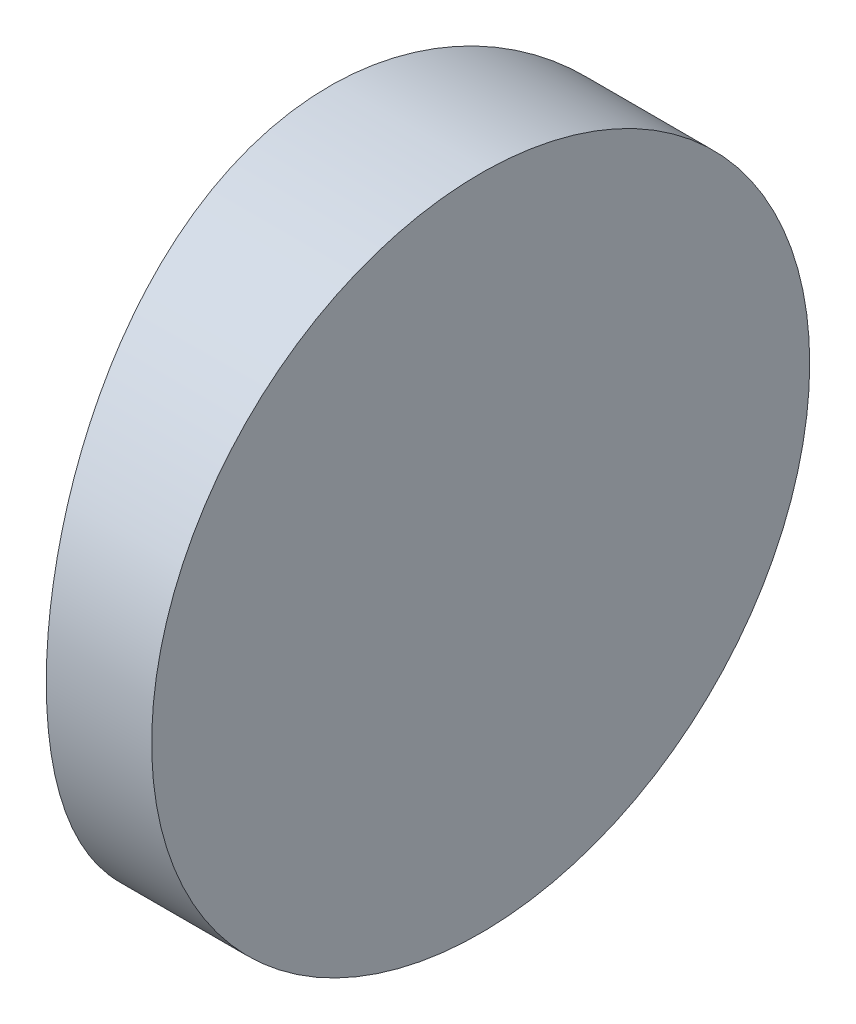
ISO-10303-21;
HEADER;
FILE_DESCRIPTION(('STEP AP214'),'2;1');
FILE_NAME('part.step','',(''),(''),'','','');
FILE_SCHEMA(('AUTOMOTIVE_DESIGN { 1 0 10303 214 1 1 1 1 }'));
ENDSEC;
DATA;
#1=APPLICATION_CONTEXT('core data for automotive mechanical design processes');
#2=APPLICATION_PROTOCOL_DEFINITION('international standard','automotive_design',2000,#1);
#3=PRODUCT_CONTEXT('',#1,'mechanical');
#4=PRODUCT('Part','Part','',(#3));
#5=PRODUCT_RELATED_PRODUCT_CATEGORY('part','',(#4));
#6=PRODUCT_DEFINITION_FORMATION('','',#4);
#7=PRODUCT_DEFINITION_CONTEXT('part definition',#1,'design');
#8=PRODUCT_DEFINITION('design','',#6,#7);
#9=PRODUCT_DEFINITION_SHAPE('','',#8);
#10=(LENGTH_UNIT() NAMED_UNIT(*) SI_UNIT(.MILLI.,.METRE.));
#11=(NAMED_UNIT(*) PLANE_ANGLE_UNIT() SI_UNIT($,.RADIAN.));
#12=(NAMED_UNIT(*) SI_UNIT($,.STERADIAN.) SOLID_ANGLE_UNIT());
#13=UNCERTAINTY_MEASURE_WITH_UNIT(LENGTH_MEASURE(1.E-05),#10,'distance_accuracy_value','');
#14=(GEOMETRIC_REPRESENTATION_CONTEXT(3) GLOBAL_UNCERTAINTY_ASSIGNED_CONTEXT((#13)) GLOBAL_UNIT_ASSIGNED_CONTEXT((#10,
#11,#12)) REPRESENTATION_CONTEXT('',''));
#15=CARTESIAN_POINT('',(0.,0.,0.));
#16=DIRECTION('',(0.,0.,1.));
#17=DIRECTION('',(1.,0.,0.));
#18=AXIS2_PLACEMENT_3D('',#15,#16,#17);
#19=CARTESIAN_POINT('',(4.35520433485127,12.5,0.));
#20=DIRECTION('',(0.,-1.,0.));
#21=DIRECTION('',(0.,0.,-1.));
#22=AXIS2_PLACEMENT_3D('',#19,#20,#21);
#23=CYLINDRICAL_SURFACE('',#22,22.93);
#24=CARTESIAN_POINT('',(-18.5747956651487,0.,0.));
#25=CARTESIAN_POINT('',(-18.5747975075132,-2.88206497799268E-06,-0.172116240904446));
#26=CARTESIAN_POINT('',(-18.5728542269794,0.0071125454654135,-0.3441960300636));
#27=CARTESIAN_POINT('',(-18.5651386677144,0.0355070712004434,-0.687149683150332));
#28=CARTESIAN_POINT('',(-18.5593656169787,0.056789025094106,-0.858023296917187));
#29=CARTESIAN_POINT('',(-18.5441420510763,0.113355737975695,-1.19737687240445));
#30=CARTESIAN_POINT('',(-18.534689178403,0.148649474009383,-1.36585522771707));
#31=CARTESIAN_POINT('',(-18.5123625379675,0.232952076452736,-1.69917642373395));
#32=CARTESIAN_POINT('',(-18.4994874887868,0.281966080720866,-1.86401787752476));
#33=CARTESIAN_POINT('',(-18.4706928395424,0.39320363664323,-2.18856018243164));
#34=CARTESIAN_POINT('',(-18.4547791016128,0.455401778940593,-2.34827025084624));
#35=CARTESIAN_POINT('',(-18.4203190141343,0.592575304890273,-2.6618366498111));
#36=CARTESIAN_POINT('',(-18.4017716782061,0.667555478003608,-2.81569075958679));
#37=CARTESIAN_POINT('',(-18.342916169584,0.91079141695951,-3.26677908619516));
#38=CARTESIAN_POINT('',(-18.2993608546125,1.09746693404617,-3.55390004287187));
#39=CARTESIAN_POINT('',(-18.2071322412475,1.51928384342409,-4.09929797343014));
#40=CARTESIAN_POINT('',(-18.1583685133213,1.75538752958156,-4.35681537706257));
#41=CARTESIAN_POINT('',(-18.0859761202817,2.13903824187728,-4.71093577418671));
#42=CARTESIAN_POINT('',(-18.0619544685581,2.27194003774992,-4.82368359085263));
#43=CARTESIAN_POINT('',(-18.014819735919,2.54677427434222,-5.03774887152665));
#44=CARTESIAN_POINT('',(-17.991706319745,2.68870333117802,-5.13907057959527));
#45=CARTESIAN_POINT('',(-17.9466134252116,2.98345979122966,-5.33139525573794));
#46=CARTESIAN_POINT('',(-17.9246636229312,3.13644244248912,-5.42216708887961));
#47=CARTESIAN_POINT('',(-17.8830414346436,3.449772827062,-5.59042344054706));
#48=CARTESIAN_POINT('',(-17.863368182456,3.6101177265413,-5.66791301813434));
#49=CARTESIAN_POINT('',(-17.8269078841955,3.93698361727225,-5.80896787054114));
#50=CARTESIAN_POINT('',(-17.8101184323237,4.10349931815857,-5.87254476421679));
#51=CARTESIAN_POINT('',(-17.7799362605068,4.44157285413049,-5.98530267421701));
#52=CARTESIAN_POINT('',(-17.7665426874325,4.6131294107181,-6.03448730671553));
#53=CARTESIAN_POINT('',(-17.7392472048781,5.02560846695819,-6.13381944691714));
#54=CARTESIAN_POINT('',(-17.7270605671705,5.26827811700073,-6.17732696870115));
#55=CARTESIAN_POINT('',(-17.7107294861358,5.75732358696326,-6.23541445556271));
#56=CARTESIAN_POINT('',(-17.7065846522162,6.00369922629656,-6.24999582559206));
#57=CARTESIAN_POINT('',(-17.7065795212784,6.42198282749614,-6.25000291483648));
#58=CARTESIAN_POINT('',(-17.7085968428445,6.59392915261917,-6.24289839954038));
#59=CARTESIAN_POINT('',(-17.7165993367766,6.93661216181474,-6.21454855376605));
#60=CARTESIAN_POINT('',(-17.7225853133849,7.10734859361473,-6.19330035708734));
#61=CARTESIAN_POINT('',(-17.7383494895108,7.44642456850869,-6.13682599336154));
#62=CARTESIAN_POINT('',(-17.748130173868,7.61476246596536,-6.10159066695166));
#63=CARTESIAN_POINT('',(-17.7711896834984,7.94779946494616,-6.01743216599849));
#64=CARTESIAN_POINT('',(-17.7844698259991,8.1124971709145,-5.96850383685538));
#65=CARTESIAN_POINT('',(-17.8141033205124,8.43673358687494,-5.85747309663171));
#66=CARTESIAN_POINT('',(-17.8304503488175,8.5962821345124,-5.79539776042242));
#67=CARTESIAN_POINT('',(-17.8657603204923,8.90953859283563,-5.65849934377744));
#68=CARTESIAN_POINT('',(-17.8847242451198,9.06324428492062,-5.58367147904053));
#69=CARTESIAN_POINT('',(-17.9447339176028,9.51392627901896,-5.34092843621856));
#70=CARTESIAN_POINT('',(-17.9889318450907,9.80082279936279,-5.15463146388042));
#71=CARTESIAN_POINT('',(-18.0820197481522,10.3464432933681,-4.73320884681729));
#72=CARTESIAN_POINT('',(-18.1309957797875,10.6043435616937,-4.49703552378388));
#73=CARTESIAN_POINT('',(-18.203250367609,10.9590248641308,-4.11315819535979));
#74=CARTESIAN_POINT('',(-18.2271495309637,11.0719564333349,-3.98016208423864));
#75=CARTESIAN_POINT('',(-18.2739042211193,11.2863768092485,-3.7051008070317));
#76=CARTESIAN_POINT('',(-18.2967601361445,11.3878698935641,-3.56303906252281));
#77=CARTESIAN_POINT('',(-18.3411965075896,11.5803983279381,-3.26816656150908));
#78=CARTESIAN_POINT('',(-18.3627473649779,11.6712177037604,-3.11521043114733));
#79=CARTESIAN_POINT('',(-18.4035092006859,11.8395715926047,-2.80192731255713));
#80=CARTESIAN_POINT('',(-18.4227210687718,11.9171111619415,-2.64160315934168));
#81=CARTESIAN_POINT('',(-18.4582498044354,12.0582663315697,-2.3147777190174));
#82=CARTESIAN_POINT('',(-18.474569031369,12.1218932895413,-2.14828160130228));
#83=CARTESIAN_POINT('',(-18.5038567179117,12.2347500199831,-1.81025467189861));
#84=CARTESIAN_POINT('',(-18.5168260081135,12.2839833616469,-1.63872511998229));
#85=CARTESIAN_POINT('',(-18.5432520539355,12.3835193705341,-1.22596271185158));
#86=CARTESIAN_POINT('',(-18.555026722623,12.4271401985556,-0.98297626549877));
#87=CARTESIAN_POINT('',(-18.5707970441783,12.4853778364874,-0.493301496475726));
#88=CARTESIAN_POINT('',(-18.5747930253535,12.4999958704906,-0.246613330483184));
#89=CARTESIAN_POINT('',(-18.5747975075132,12.500002882065,0.172116240904446));
#90=CARTESIAN_POINT('',(-18.5728542269794,12.4928874545346,0.3441960300636));
#91=CARTESIAN_POINT('',(-18.5651386677144,12.4644929287996,0.687149683150331));
#92=CARTESIAN_POINT('',(-18.5593656169787,12.4432109749059,0.858023296917186));
#93=CARTESIAN_POINT('',(-18.5441420510763,12.3866442620243,1.19737687240444));
#94=CARTESIAN_POINT('',(-18.534689178403,12.3513505259906,1.36585522771707));
#95=CARTESIAN_POINT('',(-18.5123625379675,12.2670479235473,1.69917642373395));
#96=CARTESIAN_POINT('',(-18.4994874887868,12.2180339192791,1.86401787752476));
#97=CARTESIAN_POINT('',(-18.4706928395424,12.1067963633568,2.18856018243164));
#98=CARTESIAN_POINT('',(-18.4547791016128,12.0445982210594,2.34827025084624));
#99=CARTESIAN_POINT('',(-18.4203190141343,11.9074246951097,2.6618366498111));
#100=CARTESIAN_POINT('',(-18.4017716782061,11.8324445219964,2.81569075958679));
#101=CARTESIAN_POINT('',(-18.342916169584,11.5892085830405,3.26677908619516));
#102=CARTESIAN_POINT('',(-18.2993608546125,11.4025330659538,3.55390004287187));
#103=CARTESIAN_POINT('',(-18.2071322412475,10.9807161565759,4.09929797343014));
#104=CARTESIAN_POINT('',(-18.1583685133213,10.7446124704184,4.35681537706257));
#105=CARTESIAN_POINT('',(-18.0859761202817,10.3609617581227,4.71093577418671));
#106=CARTESIAN_POINT('',(-18.0619544685581,10.2280599622501,4.82368359085263));
#107=CARTESIAN_POINT('',(-18.014819735919,9.95322572565778,5.03774887152665));
#108=CARTESIAN_POINT('',(-17.991706319745,9.81129666882198,5.13907057959527));
#109=CARTESIAN_POINT('',(-17.9466134252116,9.51654020877035,5.33139525573794));
#110=CARTESIAN_POINT('',(-17.9246636229312,9.36355755751088,5.42216708887961));
#111=CARTESIAN_POINT('',(-17.8830414346436,9.050227172938,5.59042344054705));
#112=CARTESIAN_POINT('',(-17.863368182456,8.8898822734587,5.66791301813434));
#113=CARTESIAN_POINT('',(-17.8269078841955,8.56301638272775,5.80896787054114));
#114=CARTESIAN_POINT('',(-17.8101184323237,8.39650068184143,5.87254476421679));
#115=CARTESIAN_POINT('',(-17.7799362605068,8.0584271458695,5.98530267421701));
#116=CARTESIAN_POINT('',(-17.7665426874325,7.88687058928189,6.03448730671553));
#117=CARTESIAN_POINT('',(-17.7392472048781,7.4743915330418,6.13381944691714));
#118=CARTESIAN_POINT('',(-17.7270605671705,7.23172188299927,6.17732696870115));
#119=CARTESIAN_POINT('',(-17.7107294861358,6.74267641303674,6.23541445556271));
#120=CARTESIAN_POINT('',(-17.7065846522163,6.49630077370344,6.24999582559206));
#121=CARTESIAN_POINT('',(-17.7065795212784,6.07801717250386,6.25000291483648));
#122=CARTESIAN_POINT('',(-17.7085968428445,5.90607084738083,6.24289839954038));
#123=CARTESIAN_POINT('',(-17.7165993367766,5.56338783818526,6.21454855376606));
#124=CARTESIAN_POINT('',(-17.7225853133849,5.39265140638527,6.19330035708734));
#125=CARTESIAN_POINT('',(-17.7383494895108,5.05357543149132,6.13682599336154));
#126=CARTESIAN_POINT('',(-17.748130173868,4.88523753403464,6.10159066695166));
#127=CARTESIAN_POINT('',(-17.7711896834984,4.55220053505384,6.01743216599849));
#128=CARTESIAN_POINT('',(-17.7844698259991,4.3875028290855,5.96850383685538));
#129=CARTESIAN_POINT('',(-17.8141033205124,4.06326641312506,5.85747309663171));
#130=CARTESIAN_POINT('',(-17.8304503488175,3.9037178654876,5.79539776042242));
#131=CARTESIAN_POINT('',(-17.8657603204923,3.59046140716436,5.65849934377744));
#132=CARTESIAN_POINT('',(-17.8847242451198,3.43675571507937,5.58367147904053));
#133=CARTESIAN_POINT('',(-17.9447339176028,2.98607372098104,5.34092843621855));
#134=CARTESIAN_POINT('',(-17.9889318450907,2.69917720063721,5.15463146388042));
#135=CARTESIAN_POINT('',(-18.0820197481522,2.15355670663188,4.73320884681729));
#136=CARTESIAN_POINT('',(-18.1309957797875,1.89565643830628,4.49703552378388));
#137=CARTESIAN_POINT('',(-18.203250367609,1.54097513586921,4.11315819535979));
#138=CARTESIAN_POINT('',(-18.2271495309637,1.42804356666509,3.98016208423864));
#139=CARTESIAN_POINT('',(-18.2739042211193,1.21362319075147,3.70510080703171));
#140=CARTESIAN_POINT('',(-18.2967601361445,1.11213010643587,3.56303906252281));
#141=CARTESIAN_POINT('',(-18.3411965075896,0.919601672061882,3.26816656150908));
#142=CARTESIAN_POINT('',(-18.3627473649779,0.828782296239645,3.11521043114733));
#143=CARTESIAN_POINT('',(-18.4035092006859,0.660428407395283,2.80192731255713));
#144=CARTESIAN_POINT('',(-18.4227210687718,0.5828888380585,2.64160315934169));
#145=CARTESIAN_POINT('',(-18.4582498044354,0.441733668430261,2.3147777190174));
#146=CARTESIAN_POINT('',(-18.474569031369,0.378106710458671,2.14828160130228));
#147=CARTESIAN_POINT('',(-18.5038567179117,0.26524998001692,1.81025467189861));
#148=CARTESIAN_POINT('',(-18.5168260081135,0.216016638353077,1.63872511998229));
#149=CARTESIAN_POINT('',(-18.5432520539355,0.116480629465853,1.22596271185158));
#150=CARTESIAN_POINT('',(-18.555026722623,0.0728598014444009,0.982976265498772));
#151=CARTESIAN_POINT('',(-18.5707970441783,0.0146221635126097,0.493301496475729));
#152=CARTESIAN_POINT('',(-18.5747930253535,4.12950944755007E-06,0.246613330483185));
#153=CARTESIAN_POINT('',(-18.5747956651487,0.,0.));
#154=B_SPLINE_CURVE_WITH_KNOTS('',3,(#24,#25,#26,#27,#28,#29,#30,#31,#32,#33,#34,#35,#36,#37,
#38,#39,#40,#41,#42,#43,#44,#45,#46,#47,#48,#49,#50,#51,#52,#53,#54,#55,#56,#57,#58,#59,#60,#61,
#62,#63,#64,#65,#66,#67,#68,#69,#70,#71,#72,#73,#74,#75,#76,#77,#78,#79,#80,#81,#82,#83,#84,#85,
#86,#87,#88,#89,#90,#91,#92,#93,#94,#95,#96,#97,#98,#99,#100,#101,#102,#103,#104,#105,#106,#107,
#108,#109,#110,#111,#112,#113,#114,#115,#116,#117,#118,#119,#120,#121,#122,#123,#124,#125,#126,
#127,#128,#129,#130,#131,#132,#133,#134,#135,#136,#137,#138,#139,#140,#141,#142,#143,#144,#145,
#146,#147,#148,#149,#150,#151,#152,#153),.UNSPECIFIED.,.T.,.F.,(4,2,2,2,2,2,2,2,2,2,2,2,2,2,2,2,
2,2,2,2,2,2,2,2,2,2,2,2,2,2,2,2,2,2,2,2,2,2,2,2,2,2,2,2,2,2,2,2,2,2,2,2,2,2,2,2,2,2,2,2,2,2,2,2,
4),(0.,0.516128220680413,1.03236051403015,1.54892408136976,2.0656813467546,2.58145159367465,
3.09741552758997,4.12820838395104,5.18133083975466,5.70862348791618,6.23571963133291,
6.77277482271324,7.30962499905941,7.84602511177014,8.38229033358794,9.12091195006657,
9.85949769059479,10.3752251164344,10.8910570856645,11.40722740214,11.9235922879618,
12.4389039390714,12.9544093443328,13.9843020164873,15.0384765328772,15.5662838352119,
16.0938930959035,16.6308063110698,17.1675146386904,17.7037831703432,18.2399186101558,
18.9794738740122,19.7189979235121,20.2351261441925,20.7513584375422,21.2679220048818,
21.7846792702667,22.3004495171867,22.816413451102,23.8472063074631,24.9003287632667,
25.4276214114282,25.954717554845,26.4917727462253,27.0286229225715,27.5650230352822,
28.1012882571,28.8399098735786,29.5784956141068,30.0942230399464,30.6100550091765,
31.1262253256521,31.6425902114739,32.1579018625834,32.6734072678449,33.7032999399993,
34.7574744563893,35.2852817587239,35.8128910194155,36.3498042345818,36.8865125622025,
37.4227810938552,37.9589165336679,38.6984717975242,39.4379958470241),.UNSPECIFIED.);
#155=CARTESIAN_POINT('',(-18.5747956651487,0.,0.));
#156=VERTEX_POINT('',#155);
#157=EDGE_CURVE('E10',#156,#156,#154,.T.);
#158=ORIENTED_EDGE('',*,*,#157,.F.);
#159=EDGE_LOOP('',(#158));
#160=FACE_BOUND('',#159,.T.);
#161=ADVANCED_FACE('F35',(#160),#23,.T.);
#162=CARTESIAN_POINT('',(-15.7047956651487,12.5,-6.24999999999999));
#163=DIRECTION('',(1.,0.,0.));
#164=DIRECTION('',(0.,0.,-1.));
#165=AXIS2_PLACEMENT_3D('',#162,#163,#164);
#166=PLANE('',#165);
#167=CARTESIAN_POINT('',(-15.7047956651487,6.25,0.));
#168=DIRECTION('',(1.,0.,0.));
#169=DIRECTION('',(0.,0.,-1.));
#170=AXIS2_PLACEMENT_3D('',#167,#168,#169);
#171=CIRCLE('',#170,6.25);
#172=CARTESIAN_POINT('',(-15.7047956651487,6.25,-6.25));
#173=VERTEX_POINT('',#172);
#174=EDGE_CURVE('E45',#173,#173,#171,.T.);
#175=ORIENTED_EDGE('',*,*,#174,.T.);
#176=EDGE_LOOP('',(#175));
#177=FACE_BOUND('',#176,.T.);
#178=ADVANCED_FACE('F37',(#177),#166,.T.);
#179=CARTESIAN_POINT('',(-28.4047956651487,6.25,0.));
#180=DIRECTION('',(1.,0.,0.));
#181=DIRECTION('',(0.,0.,-1.));
#182=AXIS2_PLACEMENT_3D('',#179,#180,#181);
#183=CYLINDRICAL_SURFACE('',#182,6.25);
#184=ORIENTED_EDGE('',*,*,#174,.F.);
#185=EDGE_LOOP('',(#184));
#186=FACE_BOUND('',#185,.T.);
#187=ORIENTED_EDGE('',*,*,#157,.T.);
#188=EDGE_LOOP('',(#187));
#189=FACE_BOUND('',#188,.T.);
#190=ADVANCED_FACE('F52',(#186,#189),#183,.T.);
#191=CLOSED_SHELL('',(#161,#178,#190));
#192=MANIFOLD_SOLID_BREP('B2',#191);
#193=ADVANCED_BREP_SHAPE_REPRESENTATION('',(#18,#192),#14);
#194=SHAPE_DEFINITION_REPRESENTATION(#9,#193);
ENDSEC;
END-ISO-10303-21;
